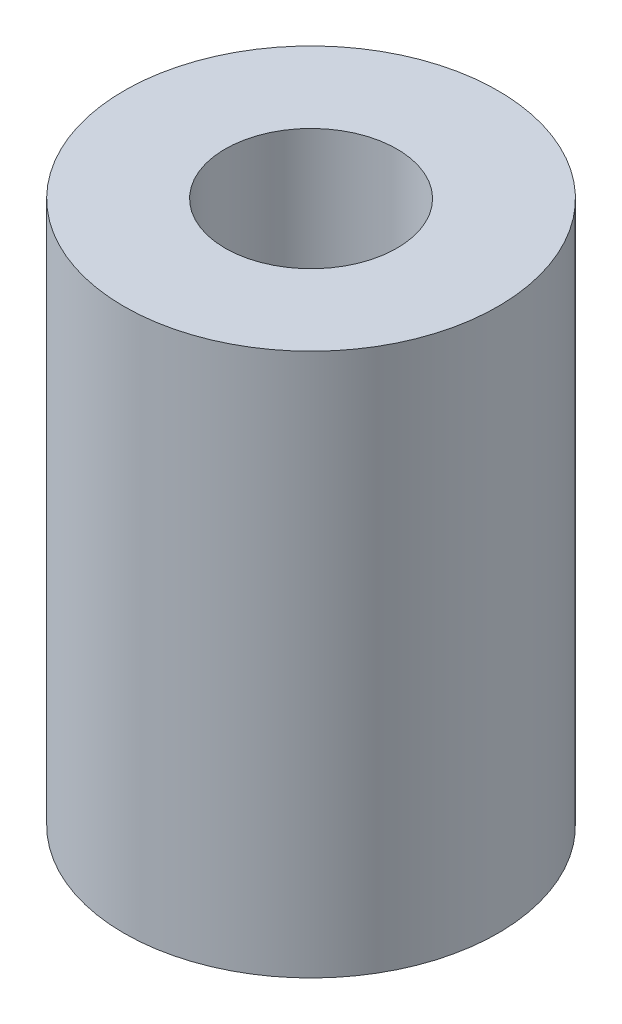
ISO-10303-21;
HEADER;
FILE_DESCRIPTION(('STEP AP214'),'2;1');
FILE_NAME('part.step','',(''),(''),'','','');
FILE_SCHEMA(('AUTOMOTIVE_DESIGN { 1 0 10303 214 1 1 1 1 }'));
ENDSEC;
DATA;
#1=APPLICATION_CONTEXT('core data for automotive mechanical design processes');
#2=APPLICATION_PROTOCOL_DEFINITION('international standard','automotive_design',2000,#1);
#3=PRODUCT_CONTEXT('',#1,'mechanical');
#4=PRODUCT('Part','Part','',(#3));
#5=PRODUCT_RELATED_PRODUCT_CATEGORY('part','',(#4));
#6=PRODUCT_DEFINITION_FORMATION('','',#4);
#7=PRODUCT_DEFINITION_CONTEXT('part definition',#1,'design');
#8=PRODUCT_DEFINITION('design','',#6,#7);
#9=PRODUCT_DEFINITION_SHAPE('','',#8);
#10=(LENGTH_UNIT() NAMED_UNIT(*) SI_UNIT(.MILLI.,.METRE.));
#11=(NAMED_UNIT(*) PLANE_ANGLE_UNIT() SI_UNIT($,.RADIAN.));
#12=(NAMED_UNIT(*) SI_UNIT($,.STERADIAN.) SOLID_ANGLE_UNIT());
#13=UNCERTAINTY_MEASURE_WITH_UNIT(LENGTH_MEASURE(1.E-05),#10,'distance_accuracy_value','');
#14=(GEOMETRIC_REPRESENTATION_CONTEXT(3) GLOBAL_UNCERTAINTY_ASSIGNED_CONTEXT((#13)) GLOBAL_UNIT_ASSIGNED_CONTEXT((#10,
#11,#12)) REPRESENTATION_CONTEXT('',''));
#15=CARTESIAN_POINT('',(0.,0.,0.));
#16=DIRECTION('',(0.,0.,1.));
#17=DIRECTION('',(1.,0.,0.));
#18=AXIS2_PLACEMENT_3D('',#15,#16,#17);
#19=CARTESIAN_POINT('',(0.,9.,0.));
#20=DIRECTION('',(0.,1.,0.));
#21=DIRECTION('',(0.,0.,1.));
#22=AXIS2_PLACEMENT_3D('',#19,#20,#21);
#23=PLANE('',#22);
#24=CARTESIAN_POINT('',(0.,9.,0.));
#25=DIRECTION('',(0.,1.,0.));
#26=DIRECTION('',(0.,0.,1.));
#27=AXIS2_PLACEMENT_3D('',#24,#25,#26);
#28=CIRCLE('',#27,3.1);
#29=CARTESIAN_POINT('',(0.,9.,3.1));
#30=VERTEX_POINT('',#29);
#31=EDGE_CURVE('E10',#30,#30,#28,.T.);
#32=ORIENTED_EDGE('',*,*,#31,.T.);
#33=EDGE_LOOP('',(#32));
#34=FACE_BOUND('',#33,.T.);
#35=CARTESIAN_POINT('',(0.,9.,0.));
#36=DIRECTION('',(0.,1.,0.));
#37=DIRECTION('',(0.,0.,1.));
#38=AXIS2_PLACEMENT_3D('',#35,#36,#37);
#39=CIRCLE('',#38,1.425);
#40=CARTESIAN_POINT('',(0.,9.,1.425));
#41=VERTEX_POINT('',#40);
#42=EDGE_CURVE('E50',#41,#41,#39,.T.);
#43=ORIENTED_EDGE('',*,*,#42,.F.);
#44=EDGE_LOOP('',(#43));
#45=FACE_BOUND('',#44,.T.);
#46=ADVANCED_FACE('F37',(#34,#45),#23,.T.);
#47=CARTESIAN_POINT('',(0.,0.,0.));
#48=DIRECTION('',(0.,1.,0.));
#49=DIRECTION('',(0.,0.,1.));
#50=AXIS2_PLACEMENT_3D('',#47,#48,#49);
#51=PLANE('',#50);
#52=CARTESIAN_POINT('',(0.,0.,0.));
#53=DIRECTION('',(0.,1.,0.));
#54=DIRECTION('',(0.,0.,1.));
#55=AXIS2_PLACEMENT_3D('',#52,#53,#54);
#56=CIRCLE('',#55,3.1);
#57=CARTESIAN_POINT('',(0.,0.,3.1));
#58=VERTEX_POINT('',#57);
#59=EDGE_CURVE('E41',#58,#58,#56,.T.);
#60=ORIENTED_EDGE('',*,*,#59,.F.);
#61=EDGE_LOOP('',(#60));
#62=FACE_BOUND('',#61,.T.);
#63=CARTESIAN_POINT('',(0.,0.,0.));
#64=DIRECTION('',(0.,1.,0.));
#65=DIRECTION('',(0.,0.,1.));
#66=AXIS2_PLACEMENT_3D('',#63,#64,#65);
#67=CIRCLE('',#66,1.425);
#68=CARTESIAN_POINT('',(0.,0.,1.425));
#69=VERTEX_POINT('',#68);
#70=EDGE_CURVE('E52',#69,#69,#67,.T.);
#71=ORIENTED_EDGE('',*,*,#70,.T.);
#72=EDGE_LOOP('',(#71));
#73=FACE_BOUND('',#72,.T.);
#74=ADVANCED_FACE('F64',(#62,#73),#51,.F.);
#75=CARTESIAN_POINT('',(0.,9.,0.));
#76=DIRECTION('',(0.,-1.,0.));
#77=DIRECTION('',(0.,0.,-1.));
#78=AXIS2_PLACEMENT_3D('',#75,#76,#77);
#79=CYLINDRICAL_SURFACE('',#78,3.1);
#80=ORIENTED_EDGE('',*,*,#31,.F.);
#81=EDGE_LOOP('',(#80));
#82=FACE_BOUND('',#81,.T.);
#83=ORIENTED_EDGE('',*,*,#59,.T.);
#84=EDGE_LOOP('',(#83));
#85=FACE_BOUND('',#84,.T.);
#86=ADVANCED_FACE('F39',(#82,#85),#79,.T.);
#87=CARTESIAN_POINT('',(0.,9.,0.));
#88=DIRECTION('',(0.,-1.,0.));
#89=DIRECTION('',(0.,0.,-1.));
#90=AXIS2_PLACEMENT_3D('',#87,#88,#89);
#91=CYLINDRICAL_SURFACE('',#90,1.425);
#92=ORIENTED_EDGE('',*,*,#42,.T.);
#93=EDGE_LOOP('',(#92));
#94=FACE_BOUND('',#93,.T.);
#95=ORIENTED_EDGE('',*,*,#70,.F.);
#96=EDGE_LOOP('',(#95));
#97=FACE_BOUND('',#96,.T.);
#98=ADVANCED_FACE('F60',(#94,#97),#91,.F.);
#99=CLOSED_SHELL('',(#46,#74,#86,#98));
#100=MANIFOLD_SOLID_BREP('B2',#99);
#101=ADVANCED_BREP_SHAPE_REPRESENTATION('',(#18,#100),#14);
#102=SHAPE_DEFINITION_REPRESENTATION(#9,#101);
ENDSEC;
END-ISO-10303-21;
